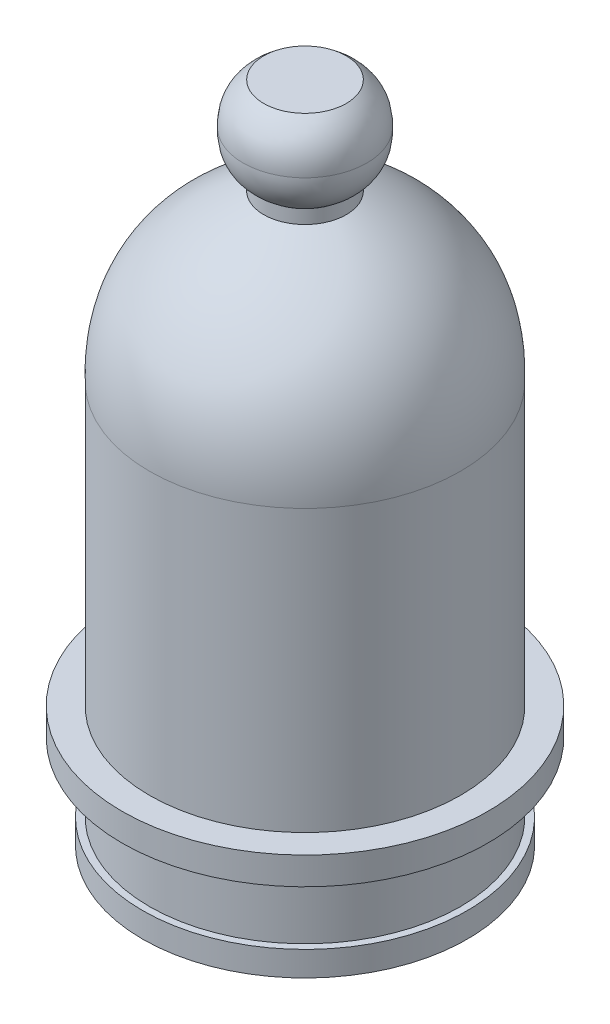
ISO-10303-21;
HEADER;
FILE_DESCRIPTION(('STEP AP214'),'2;1');
FILE_NAME('part.step','',(''),(''),'','','');
FILE_SCHEMA(('AUTOMOTIVE_DESIGN { 1 0 10303 214 1 1 1 1 }'));
ENDSEC;
DATA;
#1=APPLICATION_CONTEXT('core data for automotive mechanical design processes');
#2=APPLICATION_PROTOCOL_DEFINITION('international standard','automotive_design',2000,#1);
#3=PRODUCT_CONTEXT('',#1,'mechanical');
#4=PRODUCT('Part','Part','',(#3));
#5=PRODUCT_RELATED_PRODUCT_CATEGORY('part','',(#4));
#6=PRODUCT_DEFINITION_FORMATION('','',#4);
#7=PRODUCT_DEFINITION_CONTEXT('part definition',#1,'design');
#8=PRODUCT_DEFINITION('design','',#6,#7);
#9=PRODUCT_DEFINITION_SHAPE('','',#8);
#10=(LENGTH_UNIT() NAMED_UNIT(*) SI_UNIT(.MILLI.,.METRE.));
#11=(NAMED_UNIT(*) PLANE_ANGLE_UNIT() SI_UNIT($,.RADIAN.));
#12=(NAMED_UNIT(*) SI_UNIT($,.STERADIAN.) SOLID_ANGLE_UNIT());
#13=UNCERTAINTY_MEASURE_WITH_UNIT(LENGTH_MEASURE(1.E-05),#10,'distance_accuracy_value','');
#14=(GEOMETRIC_REPRESENTATION_CONTEXT(3) GLOBAL_UNCERTAINTY_ASSIGNED_CONTEXT((#13)) GLOBAL_UNIT_ASSIGNED_CONTEXT((#10,
#11,#12)) REPRESENTATION_CONTEXT('',''));
#15=CARTESIAN_POINT('',(0.,0.,0.));
#16=DIRECTION('',(0.,0.,1.));
#17=DIRECTION('',(1.,0.,0.));
#18=AXIS2_PLACEMENT_3D('',#15,#16,#17);
#19=CARTESIAN_POINT('',(0.,1.8,0.));
#20=DIRECTION('',(0.,-1.,0.));
#21=DIRECTION('',(0.,0.,-1.));
#22=AXIS2_PLACEMENT_3D('',#19,#20,#21);
#23=CYLINDRICAL_SURFACE('',#22,11.8);
#24=CARTESIAN_POINT('',(0.,1.8,0.));
#25=DIRECTION('',(0.,1.,0.));
#26=DIRECTION('',(0.,0.,1.));
#27=AXIS2_PLACEMENT_3D('',#24,#25,#26);
#28=CIRCLE('',#27,11.8);
#29=CARTESIAN_POINT('',(0.,1.8,11.8));
#30=VERTEX_POINT('',#29);
#31=EDGE_CURVE('E53',#30,#30,#28,.T.);
#32=ORIENTED_EDGE('',*,*,#31,.F.);
#33=EDGE_LOOP('',(#32));
#34=FACE_BOUND('',#33,.T.);
#35=CARTESIAN_POINT('',(0.,0.,0.));
#36=DIRECTION('',(0.,1.,0.));
#37=DIRECTION('',(0.,0.,1.));
#38=AXIS2_PLACEMENT_3D('',#35,#36,#37);
#39=CIRCLE('',#38,11.8);
#40=CARTESIAN_POINT('',(0.,0.,11.8));
#41=VERTEX_POINT('',#40);
#42=EDGE_CURVE('E42',#41,#41,#39,.T.);
#43=ORIENTED_EDGE('',*,*,#42,.T.);
#44=EDGE_LOOP('',(#43));
#45=FACE_BOUND('',#44,.T.);
#46=ADVANCED_FACE('F39',(#34,#45),#23,.T.);
#47=CARTESIAN_POINT('',(0.,1.8,0.));
#48=DIRECTION('',(0.,1.,0.));
#49=DIRECTION('',(0.,0.,1.));
#50=AXIS2_PLACEMENT_3D('',#47,#48,#49);
#51=PLANE('',#50);
#52=CARTESIAN_POINT('',(0.,1.8,0.));
#53=DIRECTION('',(0.,1.,0.));
#54=DIRECTION('',(0.,0.,1.));
#55=AXIS2_PLACEMENT_3D('',#52,#53,#54);
#56=CIRCLE('',#55,11.3);
#57=CARTESIAN_POINT('',(0.,1.8,11.3));
#58=VERTEX_POINT('',#57);
#59=EDGE_CURVE('E47',#58,#58,#56,.T.);
#60=ORIENTED_EDGE('',*,*,#59,.F.);
#61=EDGE_LOOP('',(#60));
#62=FACE_BOUND('',#61,.T.);
#63=ORIENTED_EDGE('',*,*,#31,.T.);
#64=EDGE_LOOP('',(#63));
#65=FACE_BOUND('',#64,.T.);
#66=ADVANCED_FACE('F82',(#62,#65),#51,.T.);
#67=CARTESIAN_POINT('',(0.,0.,0.));
#68=DIRECTION('',(0.,1.,0.));
#69=DIRECTION('',(0.,0.,1.));
#70=AXIS2_PLACEMENT_3D('',#67,#68,#69);
#71=PLANE('',#70);
#72=ORIENTED_EDGE('',*,*,#42,.F.);
#73=EDGE_LOOP('',(#72));
#74=FACE_BOUND('',#73,.T.);
#75=ADVANCED_FACE('F79',(#74),#71,.F.);
#76=CARTESIAN_POINT('',(0.,6.8,0.));
#77=DIRECTION('',(0.,-1.,0.));
#78=DIRECTION('',(0.,0.,-1.));
#79=AXIS2_PLACEMENT_3D('',#76,#77,#78);
#80=CYLINDRICAL_SURFACE('',#79,11.3);
#81=CARTESIAN_POINT('',(0.,6.8,0.));
#82=DIRECTION('',(0.,1.,0.));
#83=DIRECTION('',(0.,0.,1.));
#84=AXIS2_PLACEMENT_3D('',#81,#82,#83);
#85=CIRCLE('',#84,11.3);
#86=CARTESIAN_POINT('',(0.,6.8,11.3));
#87=VERTEX_POINT('',#86);
#88=EDGE_CURVE('E63',#87,#87,#85,.T.);
#89=ORIENTED_EDGE('',*,*,#88,.F.);
#90=EDGE_LOOP('',(#89));
#91=FACE_BOUND('',#90,.T.);
#92=ORIENTED_EDGE('',*,*,#59,.T.);
#93=EDGE_LOOP('',(#92));
#94=FACE_BOUND('',#93,.T.);
#95=ADVANCED_FACE('F81',(#91,#94),#80,.T.);
#96=CARTESIAN_POINT('',(0.,8.8,0.));
#97=DIRECTION('',(0.,-1.,0.));
#98=DIRECTION('',(0.,0.,-1.));
#99=AXIS2_PLACEMENT_3D('',#96,#97,#98);
#100=CYLINDRICAL_SURFACE('',#99,13.3);
#101=CARTESIAN_POINT('',(0.,8.8,0.));
#102=DIRECTION('',(0.,1.,0.));
#103=DIRECTION('',(0.,0.,1.));
#104=AXIS2_PLACEMENT_3D('',#101,#102,#103);
#105=CIRCLE('',#104,13.3);
#106=CARTESIAN_POINT('',(0.,8.8,13.3));
#107=VERTEX_POINT('',#106);
#108=EDGE_CURVE('E59',#107,#107,#105,.T.);
#109=ORIENTED_EDGE('',*,*,#108,.F.);
#110=EDGE_LOOP('',(#109));
#111=FACE_BOUND('',#110,.T.);
#112=CARTESIAN_POINT('',(0.,6.8,0.));
#113=DIRECTION('',(0.,1.,0.));
#114=DIRECTION('',(0.,0.,1.));
#115=AXIS2_PLACEMENT_3D('',#112,#113,#114);
#116=CIRCLE('',#115,13.3);
#117=CARTESIAN_POINT('',(0.,6.8,13.3));
#118=VERTEX_POINT('',#117);
#119=EDGE_CURVE('E64',#118,#118,#116,.T.);
#120=ORIENTED_EDGE('',*,*,#119,.T.);
#121=EDGE_LOOP('',(#120));
#122=FACE_BOUND('',#121,.T.);
#123=ADVANCED_FACE('F87',(#111,#122),#100,.T.);
#124=CARTESIAN_POINT('',(0.,8.8,0.));
#125=DIRECTION('',(0.,1.,0.));
#126=DIRECTION('',(0.,0.,1.));
#127=AXIS2_PLACEMENT_3D('',#124,#125,#126);
#128=PLANE('',#127);
#129=CARTESIAN_POINT('',(0.,8.8,0.));
#130=DIRECTION('',(0.,1.,0.));
#131=DIRECTION('',(0.,0.,1.));
#132=AXIS2_PLACEMENT_3D('',#129,#130,#131);
#133=CIRCLE('',#132,11.3);
#134=CARTESIAN_POINT('',(0.,8.8,11.3));
#135=VERTEX_POINT('',#134);
#136=EDGE_CURVE('E10',#135,#135,#133,.T.);
#137=ORIENTED_EDGE('',*,*,#136,.F.);
#138=EDGE_LOOP('',(#137));
#139=FACE_BOUND('',#138,.T.);
#140=ORIENTED_EDGE('',*,*,#108,.T.);
#141=EDGE_LOOP('',(#140));
#142=FACE_BOUND('',#141,.T.);
#143=ADVANCED_FACE('F117',(#139,#142),#128,.T.);
#144=CARTESIAN_POINT('',(0.,6.8,0.));
#145=DIRECTION('',(0.,1.,0.));
#146=DIRECTION('',(0.,0.,1.));
#147=AXIS2_PLACEMENT_3D('',#144,#145,#146);
#148=PLANE('',#147);
#149=ORIENTED_EDGE('',*,*,#88,.T.);
#150=EDGE_LOOP('',(#149));
#151=FACE_BOUND('',#150,.T.);
#152=ORIENTED_EDGE('',*,*,#119,.F.);
#153=EDGE_LOOP('',(#152));
#154=FACE_BOUND('',#153,.T.);
#155=ADVANCED_FACE('F125',(#151,#154),#148,.F.);
#156=CARTESIAN_POINT('',(0.,29.2,0.));
#157=DIRECTION('',(0.,-1.,0.));
#158=DIRECTION('',(0.,0.,-1.));
#159=AXIS2_PLACEMENT_3D('',#156,#157,#158);
#160=CYLINDRICAL_SURFACE('',#159,11.3);
#161=CARTESIAN_POINT('',(0.,29.2,0.));
#162=DIRECTION('',(0.,1.,0.));
#163=DIRECTION('',(0.,0.,1.));
#164=AXIS2_PLACEMENT_3D('',#161,#162,#163);
#165=CIRCLE('',#164,11.3);
#166=CARTESIAN_POINT('',(0.,29.2,11.3));
#167=VERTEX_POINT('',#166);
#168=EDGE_CURVE('E57',#167,#167,#165,.T.);
#169=ORIENTED_EDGE('',*,*,#168,.F.);
#170=EDGE_LOOP('',(#169));
#171=FACE_BOUND('',#170,.T.);
#172=ORIENTED_EDGE('',*,*,#136,.T.);
#173=EDGE_LOOP('',(#172));
#174=FACE_BOUND('',#173,.T.);
#175=ADVANCED_FACE('F130',(#171,#174),#160,.T.);
#176=CARTESIAN_POINT('',(0.,29.2,11.3));
#177=CARTESIAN_POINT('',(0.,37.5376551285375,11.540460591732));
#178=CARTESIAN_POINT('',(0.,41.2,3.));
#179=B_SPLINE_CURVE_WITH_KNOTS('',2,(#176,#177,#178),.UNSPECIFIED.,.F.,.F.,(3,3),(0.,1.),.UNSPECIFIED.);
#180=CARTESIAN_POINT('',(0.,29.2,0.));
#181=DIRECTION('',(0.,-1.,0.));
#182=AXIS1_PLACEMENT('',#180,#181);
#183=SURFACE_OF_REVOLUTION('',#179,#182);
#184=CARTESIAN_POINT('',(0.,41.2,0.));
#185=DIRECTION('',(0.,1.,0.));
#186=DIRECTION('',(0.,0.,1.));
#187=AXIS2_PLACEMENT_3D('',#184,#185,#186);
#188=CIRCLE('',#187,3.);
#189=CARTESIAN_POINT('',(0.,41.2,3.));
#190=VERTEX_POINT('',#189);
#191=EDGE_CURVE('E218',#190,#190,#188,.T.);
#192=ORIENTED_EDGE('',*,*,#191,.F.);
#193=EDGE_LOOP('',(#192));
#194=FACE_BOUND('',#193,.T.);
#195=ORIENTED_EDGE('',*,*,#168,.T.);
#196=EDGE_LOOP('',(#195));
#197=FACE_BOUND('',#196,.T.);
#198=ADVANCED_FACE('F147',(#194,#197),#183,.F.);
#199=CARTESIAN_POINT('',(0.,42.2,0.));
#200=DIRECTION('',(0.,-1.,0.));
#201=DIRECTION('',(0.,0.,-1.));
#202=AXIS2_PLACEMENT_3D('',#199,#200,#201);
#203=CYLINDRICAL_SURFACE('',#202,3.);
#204=CARTESIAN_POINT('',(0.,42.2,0.));
#205=DIRECTION('',(0.,1.,0.));
#206=DIRECTION('',(0.,0.,1.));
#207=AXIS2_PLACEMENT_3D('',#204,#205,#206);
#208=CIRCLE('',#207,3.);
#209=CARTESIAN_POINT('',(0.,42.2,3.));
#210=VERTEX_POINT('',#209);
#211=EDGE_CURVE('E223',#210,#210,#208,.T.);
#212=ORIENTED_EDGE('',*,*,#211,.F.);
#213=EDGE_LOOP('',(#212));
#214=FACE_BOUND('',#213,.T.);
#215=ORIENTED_EDGE('',*,*,#191,.T.);
#216=EDGE_LOOP('',(#215));
#217=FACE_BOUND('',#216,.T.);
#218=ADVANCED_FACE('F157',(#214,#217),#203,.T.);
#219=CARTESIAN_POINT('',(0.,42.2,3.));
#220=CARTESIAN_POINT('',(0.,43.3211155988233,4.57626156767994));
#221=CARTESIAN_POINT('',(0.,45.2,4.5));
#222=B_SPLINE_CURVE_WITH_KNOTS('',2,(#219,#220,#221),.UNSPECIFIED.,.F.,.F.,(3,3),(0.,1.),.UNSPECIFIED.);
#223=CARTESIAN_POINT('',(0.,42.2,0.));
#224=DIRECTION('',(0.,-1.,0.));
#225=AXIS1_PLACEMENT('',#223,#224);
#226=SURFACE_OF_REVOLUTION('',#222,#225);
#227=CARTESIAN_POINT('',(0.,45.2,0.));
#228=DIRECTION('',(0.,-1.,0.));
#229=DIRECTION('',(0.,0.,-1.));
#230=AXIS2_PLACEMENT_3D('',#227,#228,#229);
#231=CIRCLE('',#230,4.5);
#232=CARTESIAN_POINT('',(0.,45.2,-4.5));
#233=VERTEX_POINT('',#232);
#234=EDGE_CURVE('E208',#233,#233,#231,.T.);
#235=ORIENTED_EDGE('',*,*,#234,.T.);
#236=EDGE_LOOP('',(#235));
#237=FACE_BOUND('',#236,.T.);
#238=ORIENTED_EDGE('',*,*,#211,.T.);
#239=EDGE_LOOP('',(#238));
#240=FACE_BOUND('',#239,.T.);
#241=ADVANCED_FACE('F167',(#237,#240),#226,.F.);
#242=CARTESIAN_POINT('',(0.,48.2,3.));
#243=CARTESIAN_POINT('',(0.,47.0788844011767,4.57626156767994));
#244=CARTESIAN_POINT('',(0.,45.2,4.5));
#245=B_SPLINE_CURVE_WITH_KNOTS('',2,(#242,#243,#244),.UNSPECIFIED.,.F.,.F.,(3,3),(0.,1.),.UNSPECIFIED.);
#246=CARTESIAN_POINT('',(0.,48.2,0.));
#247=DIRECTION('',(0.,1.,0.));
#248=AXIS1_PLACEMENT('',#246,#247);
#249=SURFACE_OF_REVOLUTION('',#245,#248);
#250=ORIENTED_EDGE('',*,*,#234,.F.);
#251=EDGE_LOOP('',(#250));
#252=FACE_BOUND('',#251,.T.);
#253=CARTESIAN_POINT('',(0.,48.2,0.));
#254=DIRECTION('',(0.,-1.,0.));
#255=DIRECTION('',(0.,0.,-1.));
#256=AXIS2_PLACEMENT_3D('',#253,#254,#255);
#257=CIRCLE('',#256,3.);
#258=CARTESIAN_POINT('',(0.,48.2,-3.));
#259=VERTEX_POINT('',#258);
#260=EDGE_CURVE('E215',#259,#259,#257,.T.);
#261=ORIENTED_EDGE('',*,*,#260,.T.);
#262=EDGE_LOOP('',(#261));
#263=FACE_BOUND('',#262,.T.);
#264=ADVANCED_FACE('F177',(#252,#263),#249,.F.);
#265=CARTESIAN_POINT('',(0.,48.2,0.));
#266=DIRECTION('',(0.,-1.,0.));
#267=DIRECTION('',(0.,0.,1.));
#268=AXIS2_PLACEMENT_3D('',#265,#266,#267);
#269=PLANE('',#268);
#270=ORIENTED_EDGE('',*,*,#260,.F.);
#271=EDGE_LOOP('',(#270));
#272=FACE_BOUND('',#271,.T.);
#273=ADVANCED_FACE('F187',(#272),#269,.F.);
#274=CLOSED_SHELL('',(#46,#66,#75,#95,#123,#143,#155,#175,#198,#218,#241,#264,#273));
#275=MANIFOLD_SOLID_BREP('B2',#274);
#276=ADVANCED_BREP_SHAPE_REPRESENTATION('',(#18,#275),#14);
#277=SHAPE_DEFINITION_REPRESENTATION(#9,#276);
ENDSEC;
END-ISO-10303-21;
